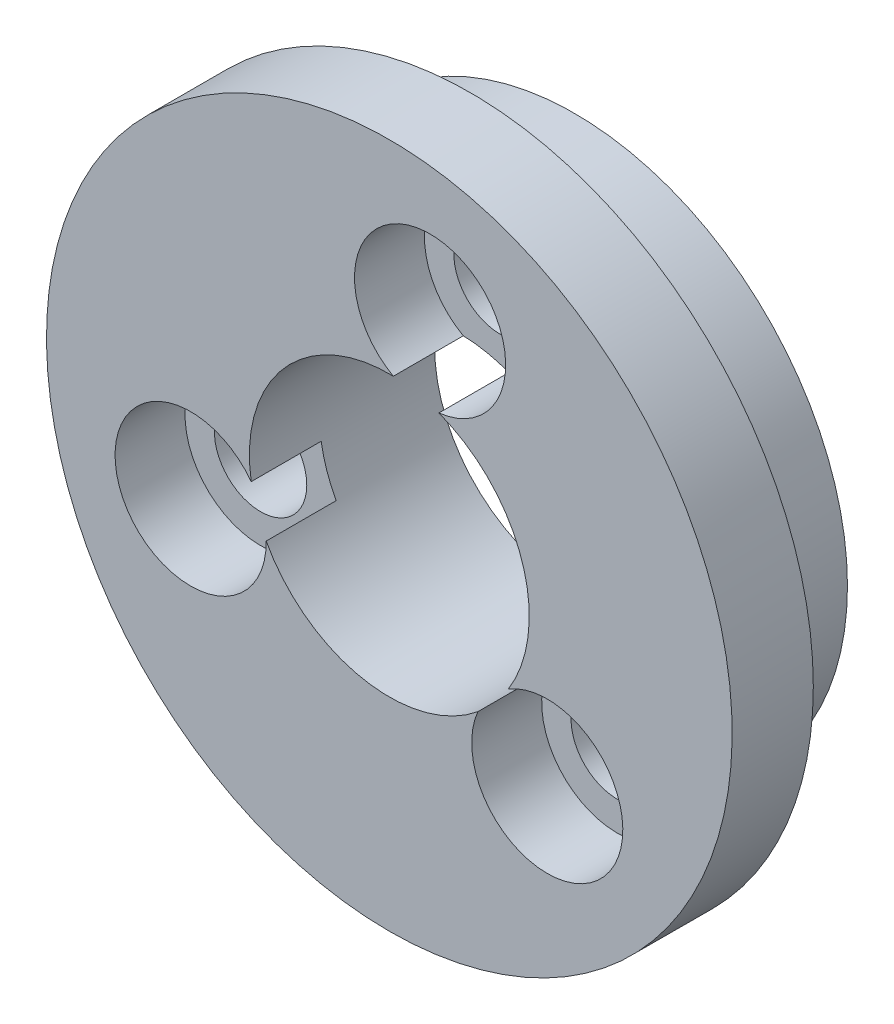
ISO-10303-21;
HEADER;
FILE_DESCRIPTION(('STEP AP214'),'2;1');
FILE_NAME('part.step','',(''),(''),'','','');
FILE_SCHEMA(('AUTOMOTIVE_DESIGN { 1 0 10303 214 1 1 1 1 }'));
ENDSEC;
DATA;
#1=APPLICATION_CONTEXT('core data for automotive mechanical design processes');
#2=APPLICATION_PROTOCOL_DEFINITION('international standard','automotive_design',2000,#1);
#3=PRODUCT_CONTEXT('',#1,'mechanical');
#4=PRODUCT('Part','Part','',(#3));
#5=PRODUCT_RELATED_PRODUCT_CATEGORY('part','',(#4));
#6=PRODUCT_DEFINITION_FORMATION('','',#4);
#7=PRODUCT_DEFINITION_CONTEXT('part definition',#1,'design');
#8=PRODUCT_DEFINITION('design','',#6,#7);
#9=PRODUCT_DEFINITION_SHAPE('','',#8);
#10=(LENGTH_UNIT() NAMED_UNIT(*) SI_UNIT(.MILLI.,.METRE.));
#11=(NAMED_UNIT(*) PLANE_ANGLE_UNIT() SI_UNIT($,.RADIAN.));
#12=(NAMED_UNIT(*) SI_UNIT($,.STERADIAN.) SOLID_ANGLE_UNIT());
#13=UNCERTAINTY_MEASURE_WITH_UNIT(LENGTH_MEASURE(1.E-05),#10,'distance_accuracy_value','');
#14=(GEOMETRIC_REPRESENTATION_CONTEXT(3) GLOBAL_UNCERTAINTY_ASSIGNED_CONTEXT((#13)) GLOBAL_UNIT_ASSIGNED_CONTEXT((#10,
#11,#12)) REPRESENTATION_CONTEXT('',''));
#15=CARTESIAN_POINT('',(0.,0.,0.));
#16=DIRECTION('',(0.,0.,1.));
#17=DIRECTION('',(1.,0.,0.));
#18=AXIS2_PLACEMENT_3D('',#15,#16,#17);
#19=CARTESIAN_POINT('',(351.606527153409,6.98970172283748,-0.00100000000000013));
#20=DIRECTION('',(0.,0.,1.));
#21=DIRECTION('',(1.,0.,0.));
#22=AXIS2_PLACEMENT_3D('',#19,#20,#21);
#23=CYLINDRICAL_SURFACE('',#22,1.64999999999999);
#24=CARTESIAN_POINT('',(351.606527153409,6.98970172283748,-3.72000000003872));
#25=DIRECTION('',(0.,0.,1.));
#26=DIRECTION('',(0.,-1.,0.));
#27=AXIS2_PLACEMENT_3D('',#24,#25,#26);
#28=CIRCLE('',#27,1.64999999999999);
#29=CARTESIAN_POINT('',(351.606527153409,5.33970172283749,-3.72000000003872));
#30=VERTEX_POINT('',#29);
#31=EDGE_CURVE('E167',#30,#30,#28,.F.);
#32=ORIENTED_EDGE('',*,*,#31,.T.);
#33=EDGE_LOOP('',(#32));
#34=FACE_BOUND('',#33,.T.);
#35=CARTESIAN_POINT('',(351.606527153409,6.98970172283748,0.399999999961173));
#36=DIRECTION('',(0.,0.,1.));
#37=DIRECTION('',(1.,0.,0.));
#38=AXIS2_PLACEMENT_3D('',#35,#36,#37);
#39=CIRCLE('',#38,1.64999999999999);
#40=CARTESIAN_POINT('',(353.256527153409,6.98970172283748,0.399999999961173));
#41=VERTEX_POINT('',#40);
#42=EDGE_CURVE('E145',#41,#41,#39,.F.);
#43=ORIENTED_EDGE('',*,*,#42,.F.);
#44=EDGE_LOOP('',(#43));
#45=FACE_BOUND('',#44,.T.);
#46=ADVANCED_FACE('F39',(#34,#45),#23,.F.);
#47=CARTESIAN_POINT('',(355.793266576135,-5.30750173999055,-0.00100000000000013));
#48=DIRECTION('',(0.,0.,1.));
#49=DIRECTION('',(1.,0.,0.));
#50=AXIS2_PLACEMENT_3D('',#47,#48,#49);
#51=CYLINDRICAL_SURFACE('',#50,1.64999999999999);
#52=CARTESIAN_POINT('',(355.793266576135,-5.30750173999055,-3.72000000003869));
#53=DIRECTION('',(0.,0.,1.));
#54=DIRECTION('',(0.,-1.,0.));
#55=AXIS2_PLACEMENT_3D('',#52,#53,#54);
#56=CIRCLE('',#55,1.64999999999999);
#57=CARTESIAN_POINT('',(355.793266576135,-6.95750173999054,-3.72000000003869));
#58=VERTEX_POINT('',#57);
#59=EDGE_CURVE('E166',#58,#58,#56,.F.);
#60=ORIENTED_EDGE('',*,*,#59,.T.);
#61=EDGE_LOOP('',(#60));
#62=FACE_BOUND('',#61,.T.);
#63=CARTESIAN_POINT('',(355.793266576135,-5.30750173999055,0.399999999961173));
#64=DIRECTION('',(0.,0.,1.));
#65=DIRECTION('',(1.,0.,0.));
#66=AXIS2_PLACEMENT_3D('',#63,#64,#65);
#67=CIRCLE('',#66,1.64999999999999);
#68=CARTESIAN_POINT('',(357.443266576135,-5.30750173999055,0.399999999961173));
#69=VERTEX_POINT('',#68);
#70=EDGE_CURVE('E141',#69,#69,#67,.F.);
#71=ORIENTED_EDGE('',*,*,#70,.F.);
#72=EDGE_LOOP('',(#71));
#73=FACE_BOUND('',#72,.T.);
#74=ADVANCED_FACE('F196',(#62,#73),#51,.F.);
#75=CARTESIAN_POINT('',(343.050206270457,-2.78472270768336,-0.00100000000000013));
#76=DIRECTION('',(0.,0.,1.));
#77=DIRECTION('',(1.,0.,0.));
#78=AXIS2_PLACEMENT_3D('',#75,#76,#77);
#79=CYLINDRICAL_SURFACE('',#78,1.64999999999999);
#80=CARTESIAN_POINT('',(343.050206270457,-2.78472270768337,-3.7200000000387));
#81=DIRECTION('',(0.,0.,1.));
#82=DIRECTION('',(0.,-1.,0.));
#83=AXIS2_PLACEMENT_3D('',#80,#81,#82);
#84=CIRCLE('',#83,1.64999999999999);
#85=CARTESIAN_POINT('',(343.050206270457,-4.43472270768335,-3.7200000000387));
#86=VERTEX_POINT('',#85);
#87=EDGE_CURVE('E171',#86,#86,#84,.F.);
#88=ORIENTED_EDGE('',*,*,#87,.T.);
#89=EDGE_LOOP('',(#88));
#90=FACE_BOUND('',#89,.T.);
#91=CARTESIAN_POINT('',(343.050206270457,-2.78472270768336,0.399999999961173));
#92=DIRECTION('',(0.,0.,1.));
#93=DIRECTION('',(1.,0.,0.));
#94=AXIS2_PLACEMENT_3D('',#91,#92,#93);
#95=CIRCLE('',#94,1.64999999999999);
#96=CARTESIAN_POINT('',(344.700206270457,-2.78472270768336,0.399999999961173));
#97=VERTEX_POINT('',#96);
#98=EDGE_CURVE('E138',#97,#97,#95,.F.);
#99=ORIENTED_EDGE('',*,*,#98,.F.);
#100=EDGE_LOOP('',(#99));
#101=FACE_BOUND('',#100,.T.);
#102=ADVANCED_FACE('F202',(#90,#101),#79,.F.);
#103=CARTESIAN_POINT('',(350.15,-0.367507574945491,0.));
#104=DIRECTION('',(0.,0.,1.));
#105=DIRECTION('',(1.,0.,0.));
#106=AXIS2_PLACEMENT_3D('',#103,#104,#105);
#107=PLANE('',#106);
#108=CARTESIAN_POINT('',(350.15,-0.367507574945491,0.));
#109=DIRECTION('',(0.,0.,1.));
#110=DIRECTION('',(1.,0.,0.));
#111=AXIS2_PLACEMENT_3D('',#108,#109,#110);
#112=CIRCLE('',#111,12.25);
#113=CARTESIAN_POINT('',(362.4,-0.367507574945491,0.));
#114=VERTEX_POINT('',#113);
#115=EDGE_CURVE('E124',#114,#114,#112,.T.);
#116=ORIENTED_EDGE('',*,*,#115,.F.);
#117=EDGE_LOOP('',(#116));
#118=FACE_BOUND('',#117,.T.);
#119=CARTESIAN_POINT('',(350.15,-0.367507574945587,0.));
#120=DIRECTION('',(0.,0.,1.));
#121=DIRECTION('',(1.,0.,0.));
#122=AXIS2_PLACEMENT_3D('',#119,#120,#121);
#123=CIRCLE('',#122,9.74999999999997);
#124=CARTESIAN_POINT('',(359.9,-0.367507574945587,0.));
#125=VERTEX_POINT('',#124);
#126=EDGE_CURVE('E135',#125,#125,#123,.F.);
#127=ORIENTED_EDGE('',*,*,#126,.F.);
#128=EDGE_LOOP('',(#127));
#129=FACE_BOUND('',#128,.T.);
#130=ADVANCED_FACE('F209',(#118,#129),#107,.F.);
#131=CARTESIAN_POINT('',(350.15,-0.367507574945491,37.5482322781021));
#132=DIRECTION('',(0.,0.,-1.));
#133=DIRECTION('',(-1.,0.,0.));
#134=AXIS2_PLACEMENT_3D('',#131,#132,#133);
#135=CYLINDRICAL_SURFACE('',#134,12.25);
#136=ORIENTED_EDGE('',*,*,#115,.T.);
#137=EDGE_LOOP('',(#136));
#138=FACE_BOUND('',#137,.T.);
#139=CARTESIAN_POINT('',(350.15,-0.367507574945491,2.89999999996134));
#140=DIRECTION('',(0.,0.,1.));
#141=DIRECTION('',(0.,-1.,0.));
#142=AXIS2_PLACEMENT_3D('',#139,#140,#141);
#143=CIRCLE('',#142,12.25);
#144=CARTESIAN_POINT('',(350.15,-12.6175075749455,2.89999999996135));
#145=VERTEX_POINT('',#144);
#146=EDGE_CURVE('E132',#145,#145,#143,.T.);
#147=ORIENTED_EDGE('',*,*,#146,.F.);
#148=EDGE_LOOP('',(#147));
#149=FACE_BOUND('',#148,.T.);
#150=ADVANCED_FACE('F192',(#138,#149),#135,.T.);
#151=CARTESIAN_POINT('',(53.760517894235,-19.4010279292079,2.89999999996122));
#152=DIRECTION('',(0.,0.,1.));
#153=DIRECTION('',(0.997944384194496,0.0640859271187287,0.));
#154=AXIS2_PLACEMENT_3D('',#151,#152,#153);
#155=PLANE('',#154);
#156=CARTESIAN_POINT('',(351.606527153409,6.98970172283748,2.89999999996117));
#157=DIRECTION('',(0.,0.,1.));
#158=DIRECTION('',(1.,0.,0.));
#159=AXIS2_PLACEMENT_3D('',#156,#157,#158);
#160=CIRCLE('',#159,2.69999999999996);
#161=CARTESIAN_POINT('',(351.921530236478,4.30814004022474,2.89999999996117));
#162=VERTEX_POINT('',#161);
#163=CARTESIAN_POINT('',(350.293576399365,4.63043058168926,2.89999999996117));
#164=VERTEX_POINT('',#163);
#165=EDGE_CURVE('E156',#162,#164,#160,.T.);
#166=ORIENTED_EDGE('',*,*,#165,.F.);
#167=CARTESIAN_POINT('',(350.15,-0.367507574945488,2.89999999996117));
#168=DIRECTION('',(0.,0.,1.));
#169=DIRECTION('',(1.,0.,0.));
#170=AXIS2_PLACEMENT_3D('',#167,#168,#169);
#171=CIRCLE('',#170,4.99999999999999);
#172=CARTESIAN_POINT('',(354.406553210508,-2.99081746249628,2.89999999996117));
#173=VERTEX_POINT('',#172);
#174=EDGE_CURVE('E122',#173,#162,#171,.T.);
#175=ORIENTED_EDGE('',*,*,#174,.F.);
#176=CARTESIAN_POINT('',(355.793266576135,-5.30750173999055,2.89999999996117));
#177=DIRECTION('',(0.,0.,1.));
#178=DIRECTION('',(1.,0.,0.));
#179=AXIS2_PLACEMENT_3D('',#176,#177,#178);
#180=CIRCLE('',#179,2.69999999999996);
#181=CARTESIAN_POINT('',(353.313464495643,-4.23952157089216,2.89999999996117));
#182=VERTEX_POINT('',#181);
#183=EDGE_CURVE('E120',#182,#173,#180,.T.);
#184=ORIENTED_EDGE('',*,*,#183,.F.);
#185=CARTESIAN_POINT('',(345.749870390129,-2.74213584402943,2.89999999996117));
#186=VERTEX_POINT('',#185);
#187=EDGE_CURVE('E112',#186,#182,#171,.T.);
#188=ORIENTED_EDGE('',*,*,#187,.F.);
#189=CARTESIAN_POINT('',(343.050206270457,-2.78472270768336,2.89999999996117));
#190=DIRECTION('',(0.,0.,1.));
#191=DIRECTION('',(1.,0.,0.));
#192=AXIS2_PLACEMENT_3D('',#189,#190,#191);
#193=CIRCLE('',#192,2.69999999999996);
#194=CARTESIAN_POINT('',(345.21500526788,-1.17114119416898,2.89999999996117));
#195=VERTEX_POINT('',#194);
#196=EDGE_CURVE('E92',#195,#186,#193,.T.);
#197=ORIENTED_EDGE('',*,*,#196,.F.);
#198=EDGE_CURVE('E121',#164,#195,#171,.T.);
#199=ORIENTED_EDGE('',*,*,#198,.F.);
#200=EDGE_LOOP('',(#166,#175,#184,#188,#197,#199));
#201=FACE_BOUND('',#200,.T.);
#202=ORIENTED_EDGE('',*,*,#146,.T.);
#203=EDGE_LOOP('',(#202));
#204=FACE_BOUND('',#203,.T.);
#205=ADVANCED_FACE('F41',(#201,#204),#155,.T.);
#206=CARTESIAN_POINT('',(350.15,-0.367507574945488,-0.00100000000000013));
#207=DIRECTION('',(0.,0.,1.));
#208=DIRECTION('',(1.,0.,0.));
#209=AXIS2_PLACEMENT_3D('',#206,#207,#208);
#210=CYLINDRICAL_SURFACE('',#209,4.99999999999999);
#211=CARTESIAN_POINT('',(350.15,-0.367507574945488,0.399999999961173));
#212=DIRECTION('',(0.,0.,1.));
#213=DIRECTION('',(1.,0.,0.));
#214=AXIS2_PLACEMENT_3D('',#211,#212,#213);
#215=CIRCLE('',#214,4.99999999999999);
#216=CARTESIAN_POINT('',(350.293576399365,4.63043058168926,0.399999999961173));
#217=VERTEX_POINT('',#216);
#218=CARTESIAN_POINT('',(351.921530236478,4.30814004022474,0.399999999961173));
#219=VERTEX_POINT('',#218);
#220=EDGE_CURVE('E148',#217,#219,#215,.F.);
#221=ORIENTED_EDGE('',*,*,#220,.F.);
#222=DIRECTION('',(0.,0.,1.));
#223=VECTOR('',#222,1.);
#224=CARTESIAN_POINT('',(350.293576399365,4.63043058168926,1.64999999996117));
#225=LINE('',#224,#223);
#226=EDGE_CURVE('E11',#217,#164,#225,.T.);
#227=ORIENTED_EDGE('',*,*,#226,.T.);
#228=ORIENTED_EDGE('',*,*,#198,.T.);
#229=DIRECTION('',(0.,0.,1.));
#230=VECTOR('',#229,1.);
#231=CARTESIAN_POINT('',(345.21500526788,-1.17114119416898,1.64999999996117));
#232=LINE('',#231,#230);
#233=CARTESIAN_POINT('',(345.21500526788,-1.17114119416898,0.399999999961173));
#234=VERTEX_POINT('',#233);
#235=EDGE_CURVE('E99',#195,#234,#232,.F.);
#236=ORIENTED_EDGE('',*,*,#235,.T.);
#237=CARTESIAN_POINT('',(350.15,-0.367507574945488,0.399999999961173));
#238=DIRECTION('',(0.,0.,1.));
#239=DIRECTION('',(1.,0.,0.));
#240=AXIS2_PLACEMENT_3D('',#237,#238,#239);
#241=CIRCLE('',#240,4.99999999999999);
#242=CARTESIAN_POINT('',(345.749870390129,-2.74213584402943,0.399999999961173));
#243=VERTEX_POINT('',#242);
#244=EDGE_CURVE('E113',#243,#234,#241,.F.);
#245=ORIENTED_EDGE('',*,*,#244,.F.);
#246=DIRECTION('',(0.,0.,1.));
#247=VECTOR('',#246,1.);
#248=CARTESIAN_POINT('',(345.749870390129,-2.74213584402944,1.64999999996117));
#249=LINE('',#248,#247);
#250=EDGE_CURVE('E96',#243,#186,#249,.T.);
#251=ORIENTED_EDGE('',*,*,#250,.T.);
#252=ORIENTED_EDGE('',*,*,#187,.T.);
#253=DIRECTION('',(0.,0.,1.));
#254=VECTOR('',#253,1.);
#255=CARTESIAN_POINT('',(353.313464495643,-4.23952157089216,1.64999999996117));
#256=LINE('',#255,#254);
#257=CARTESIAN_POINT('',(353.313464495643,-4.23952157089216,0.399999999961173));
#258=VERTEX_POINT('',#257);
#259=EDGE_CURVE('E114',#182,#258,#256,.F.);
#260=ORIENTED_EDGE('',*,*,#259,.T.);
#261=CARTESIAN_POINT('',(350.15,-0.367507574945488,0.399999999961173));
#262=DIRECTION('',(0.,0.,1.));
#263=DIRECTION('',(1.,0.,0.));
#264=AXIS2_PLACEMENT_3D('',#261,#262,#263);
#265=CIRCLE('',#264,4.99999999999999);
#266=CARTESIAN_POINT('',(354.406553210508,-2.99081746249628,0.399999999961173));
#267=VERTEX_POINT('',#266);
#268=EDGE_CURVE('E144',#267,#258,#265,.F.);
#269=ORIENTED_EDGE('',*,*,#268,.F.);
#270=DIRECTION('',(0.,0.,1.));
#271=VECTOR('',#270,1.);
#272=CARTESIAN_POINT('',(354.406553210508,-2.99081746249627,1.64999999996117));
#273=LINE('',#272,#271);
#274=EDGE_CURVE('E151',#267,#173,#273,.T.);
#275=ORIENTED_EDGE('',*,*,#274,.T.);
#276=ORIENTED_EDGE('',*,*,#174,.T.);
#277=DIRECTION('',(0.,0.,1.));
#278=VECTOR('',#277,1.);
#279=CARTESIAN_POINT('',(351.921530236478,4.30814004022474,1.64999999996117));
#280=LINE('',#279,#278);
#281=EDGE_CURVE('E47',#162,#219,#280,.F.);
#282=ORIENTED_EDGE('',*,*,#281,.T.);
#283=EDGE_LOOP('',(#221,#227,#228,#236,#245,#251,#252,#260,#269,#275,#276,#282));
#284=FACE_BOUND('',#283,.T.);
#285=CARTESIAN_POINT('',(350.15,-0.367507574945587,-3.72000000003871));
#286=DIRECTION('',(0.,0.,1.));
#287=DIRECTION('',(0.,-1.,0.));
#288=AXIS2_PLACEMENT_3D('',#285,#286,#287);
#289=CIRCLE('',#288,4.99999999999981);
#290=CARTESIAN_POINT('',(350.15,-5.3675075749454,-3.7200000000387));
#291=VERTEX_POINT('',#290);
#292=EDGE_CURVE('E126',#291,#291,#289,.T.);
#293=ORIENTED_EDGE('',*,*,#292,.F.);
#294=EDGE_LOOP('',(#293));
#295=FACE_BOUND('',#294,.T.);
#296=ADVANCED_FACE('F109',(#284,#295),#210,.F.);
#297=CARTESIAN_POINT('',(350.15,-0.367507574945587,-31.297164466314));
#298=DIRECTION('',(0.,0.,1.));
#299=DIRECTION('',(1.,0.,0.));
#300=AXIS2_PLACEMENT_3D('',#297,#298,#299);
#301=CYLINDRICAL_SURFACE('',#300,9.74999999999997);
#302=CARTESIAN_POINT('',(350.15,-0.367507574945587,-3.72000000003871));
#303=DIRECTION('',(0.,0.,1.));
#304=DIRECTION('',(0.,-1.,0.));
#305=AXIS2_PLACEMENT_3D('',#302,#303,#304);
#306=CIRCLE('',#305,9.74999999999997);
#307=CARTESIAN_POINT('',(350.15,-10.1175075749456,-3.72000000003869));
#308=VERTEX_POINT('',#307);
#309=EDGE_CURVE('E170',#308,#308,#306,.T.);
#310=ORIENTED_EDGE('',*,*,#309,.T.);
#311=EDGE_LOOP('',(#310));
#312=FACE_BOUND('',#311,.T.);
#313=ORIENTED_EDGE('',*,*,#126,.T.);
#314=EDGE_LOOP('',(#313));
#315=FACE_BOUND('',#314,.T.);
#316=ADVANCED_FACE('F184',(#312,#315),#301,.T.);
#317=CARTESIAN_POINT('',(350.15,-0.367507574945525,-3.72000000003871));
#318=DIRECTION('',(0.,0.,1.));
#319=DIRECTION('',(0.997944384194497,0.0640859271187285,0.));
#320=AXIS2_PLACEMENT_3D('',#317,#318,#319);
#321=PLANE('',#320);
#322=ORIENTED_EDGE('',*,*,#31,.F.);
#323=EDGE_LOOP('',(#322));
#324=FACE_BOUND('',#323,.T.);
#325=ORIENTED_EDGE('',*,*,#87,.F.);
#326=EDGE_LOOP('',(#325));
#327=FACE_BOUND('',#326,.T.);
#328=ORIENTED_EDGE('',*,*,#59,.F.);
#329=EDGE_LOOP('',(#328));
#330=FACE_BOUND('',#329,.T.);
#331=ORIENTED_EDGE('',*,*,#292,.T.);
#332=EDGE_LOOP('',(#331));
#333=FACE_BOUND('',#332,.T.);
#334=ORIENTED_EDGE('',*,*,#309,.F.);
#335=EDGE_LOOP('',(#334));
#336=FACE_BOUND('',#335,.T.);
#337=ADVANCED_FACE('F181',(#324,#327,#330,#333,#336),#321,.F.);
#338=CARTESIAN_POINT('',(343.050206270457,-2.78472270768336,0.399999999961173));
#339=DIRECTION('',(0.,0.,1.));
#340=DIRECTION('',(1.,0.,0.));
#341=AXIS2_PLACEMENT_3D('',#338,#339,#340);
#342=CYLINDRICAL_SURFACE('',#341,2.69999999999996);
#343=CARTESIAN_POINT('',(343.050206270457,-2.78472270768336,0.399999999961173));
#344=DIRECTION('',(0.,0.,1.));
#345=DIRECTION('',(1.,0.,0.));
#346=AXIS2_PLACEMENT_3D('',#343,#344,#345);
#347=CIRCLE('',#346,2.69999999999996);
#348=EDGE_CURVE('E104',#234,#243,#347,.T.);
#349=ORIENTED_EDGE('',*,*,#348,.F.);
#350=ORIENTED_EDGE('',*,*,#235,.F.);
#351=ORIENTED_EDGE('',*,*,#196,.T.);
#352=ORIENTED_EDGE('',*,*,#250,.F.);
#353=EDGE_LOOP('',(#349,#350,#351,#352));
#354=FACE_BOUND('',#353,.T.);
#355=ADVANCED_FACE('F95',(#354),#342,.F.);
#356=CARTESIAN_POINT('',(343.050206270457,-2.78472270768336,0.399999999961173));
#357=DIRECTION('',(0.,0.,1.));
#358=DIRECTION('',(1.,0.,0.));
#359=AXIS2_PLACEMENT_3D('',#356,#357,#358);
#360=PLANE('',#359);
#361=ORIENTED_EDGE('',*,*,#98,.T.);
#362=EDGE_LOOP('',(#361));
#363=FACE_BOUND('',#362,.T.);
#364=ORIENTED_EDGE('',*,*,#244,.T.);
#365=ORIENTED_EDGE('',*,*,#348,.T.);
#366=EDGE_LOOP('',(#364,#365));
#367=FACE_BOUND('',#366,.T.);
#368=ADVANCED_FACE('F213',(#363,#367),#360,.T.);
#369=CARTESIAN_POINT('',(355.793266576135,-5.30750173999055,0.399999999961173));
#370=DIRECTION('',(0.,0.,1.));
#371=DIRECTION('',(1.,0.,0.));
#372=AXIS2_PLACEMENT_3D('',#369,#370,#371);
#373=CYLINDRICAL_SURFACE('',#372,2.69999999999996);
#374=CARTESIAN_POINT('',(355.793266576135,-5.30750173999055,0.399999999961173));
#375=DIRECTION('',(0.,0.,1.));
#376=DIRECTION('',(1.,0.,0.));
#377=AXIS2_PLACEMENT_3D('',#374,#375,#376);
#378=CIRCLE('',#377,2.69999999999996);
#379=EDGE_CURVE('E60',#258,#267,#378,.T.);
#380=ORIENTED_EDGE('',*,*,#379,.F.);
#381=ORIENTED_EDGE('',*,*,#259,.F.);
#382=ORIENTED_EDGE('',*,*,#183,.T.);
#383=ORIENTED_EDGE('',*,*,#274,.F.);
#384=EDGE_LOOP('',(#380,#381,#382,#383));
#385=FACE_BOUND('',#384,.T.);
#386=ADVANCED_FACE('F216',(#385),#373,.F.);
#387=CARTESIAN_POINT('',(355.793266576135,-5.30750173999055,0.399999999961173));
#388=DIRECTION('',(0.,0.,1.));
#389=DIRECTION('',(1.,0.,0.));
#390=AXIS2_PLACEMENT_3D('',#387,#388,#389);
#391=PLANE('',#390);
#392=ORIENTED_EDGE('',*,*,#70,.T.);
#393=EDGE_LOOP('',(#392));
#394=FACE_BOUND('',#393,.T.);
#395=ORIENTED_EDGE('',*,*,#268,.T.);
#396=ORIENTED_EDGE('',*,*,#379,.T.);
#397=EDGE_LOOP('',(#395,#396));
#398=FACE_BOUND('',#397,.T.);
#399=ADVANCED_FACE('F219',(#394,#398),#391,.T.);
#400=CARTESIAN_POINT('',(351.606527153409,6.98970172283748,0.399999999961173));
#401=DIRECTION('',(0.,0.,1.));
#402=DIRECTION('',(1.,0.,0.));
#403=AXIS2_PLACEMENT_3D('',#400,#401,#402);
#404=CYLINDRICAL_SURFACE('',#403,2.69999999999996);
#405=CARTESIAN_POINT('',(351.606527153409,6.98970172283748,0.399999999961173));
#406=DIRECTION('',(0.,0.,1.));
#407=DIRECTION('',(1.,0.,0.));
#408=AXIS2_PLACEMENT_3D('',#405,#406,#407);
#409=CIRCLE('',#408,2.69999999999996);
#410=EDGE_CURVE('E53',#219,#217,#409,.T.);
#411=ORIENTED_EDGE('',*,*,#410,.F.);
#412=ORIENTED_EDGE('',*,*,#281,.F.);
#413=ORIENTED_EDGE('',*,*,#165,.T.);
#414=ORIENTED_EDGE('',*,*,#226,.F.);
#415=EDGE_LOOP('',(#411,#412,#413,#414));
#416=FACE_BOUND('',#415,.T.);
#417=ADVANCED_FACE('F155',(#416),#404,.F.);
#418=CARTESIAN_POINT('',(351.606527153409,6.98970172283748,0.399999999961173));
#419=DIRECTION('',(0.,0.,1.));
#420=DIRECTION('',(1.,0.,0.));
#421=AXIS2_PLACEMENT_3D('',#418,#419,#420);
#422=PLANE('',#421);
#423=ORIENTED_EDGE('',*,*,#42,.T.);
#424=EDGE_LOOP('',(#423));
#425=FACE_BOUND('',#424,.T.);
#426=ORIENTED_EDGE('',*,*,#220,.T.);
#427=ORIENTED_EDGE('',*,*,#410,.T.);
#428=EDGE_LOOP('',(#426,#427));
#429=FACE_BOUND('',#428,.T.);
#430=ADVANCED_FACE('F228',(#425,#429),#422,.T.);
#431=CLOSED_SHELL('',(#46,#74,#102,#130,#150,#205,#296,#316,#337,#355,#368,#386,#399,#417,#430));
#432=MANIFOLD_SOLID_BREP('B2',#431);
#433=ADVANCED_BREP_SHAPE_REPRESENTATION('',(#18,#432),#14);
#434=SHAPE_DEFINITION_REPRESENTATION(#9,#433);
ENDSEC;
END-ISO-10303-21;
